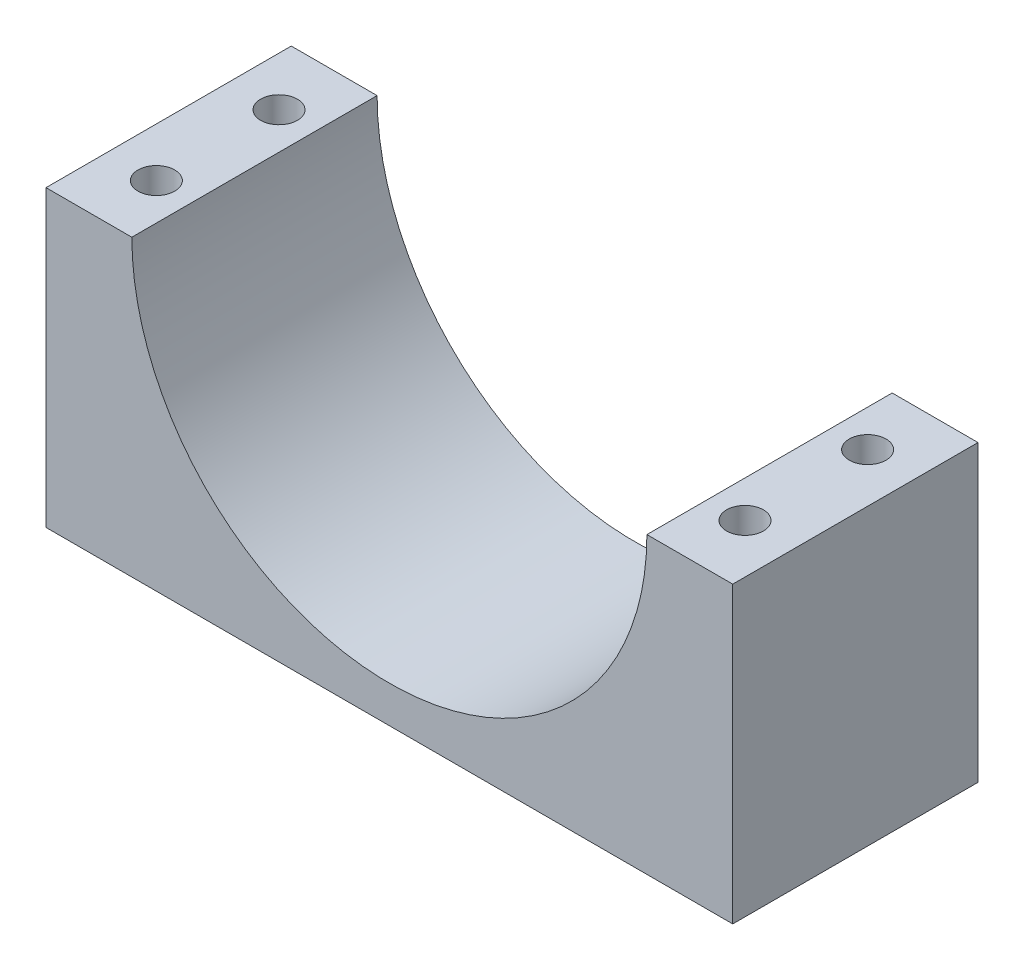
ISO-10303-21;
HEADER;
FILE_DESCRIPTION(('STEP AP214'),'2;1');
FILE_NAME('part.step','',(''),(''),'','','');
FILE_SCHEMA(('AUTOMOTIVE_DESIGN { 1 0 10303 214 1 1 1 1 }'));
ENDSEC;
DATA;
#1=APPLICATION_CONTEXT('core data for automotive mechanical design processes');
#2=APPLICATION_PROTOCOL_DEFINITION('international standard','automotive_design',2000,#1);
#3=PRODUCT_CONTEXT('',#1,'mechanical');
#4=PRODUCT('Part','Part','',(#3));
#5=PRODUCT_RELATED_PRODUCT_CATEGORY('part','',(#4));
#6=PRODUCT_DEFINITION_FORMATION('','',#4);
#7=PRODUCT_DEFINITION_CONTEXT('part definition',#1,'design');
#8=PRODUCT_DEFINITION('design','',#6,#7);
#9=PRODUCT_DEFINITION_SHAPE('','',#8);
#10=(LENGTH_UNIT() NAMED_UNIT(*) SI_UNIT(.MILLI.,.METRE.));
#11=(NAMED_UNIT(*) PLANE_ANGLE_UNIT() SI_UNIT($,.RADIAN.));
#12=(NAMED_UNIT(*) SI_UNIT($,.STERADIAN.) SOLID_ANGLE_UNIT());
#13=UNCERTAINTY_MEASURE_WITH_UNIT(LENGTH_MEASURE(1.E-05),#10,'distance_accuracy_value','');
#14=(GEOMETRIC_REPRESENTATION_CONTEXT(3) GLOBAL_UNCERTAINTY_ASSIGNED_CONTEXT((#13)) GLOBAL_UNIT_ASSIGNED_CONTEXT((#10,
#11,#12)) REPRESENTATION_CONTEXT('',''));
#15=CARTESIAN_POINT('',(0.,0.,0.));
#16=DIRECTION('',(0.,0.,1.));
#17=DIRECTION('',(1.,0.,0.));
#18=AXIS2_PLACEMENT_3D('',#15,#16,#17);
#19=CARTESIAN_POINT('',(-21.,0.,20.));
#20=DIRECTION('',(0.,-1.,0.));
#21=DIRECTION('',(1.,0.,0.));
#22=AXIS2_PLACEMENT_3D('',#19,#20,#21);
#23=PLANE('',#22);
#24=CARTESIAN_POINT('',(-24.,0.,5.));
#25=DIRECTION('',(0.,1.,0.));
#26=DIRECTION('',(0.,0.,1.));
#27=AXIS2_PLACEMENT_3D('',#24,#25,#26);
#28=CIRCLE('',#27,1.5);
#29=CARTESIAN_POINT('',(-24.,0.,6.5));
#30=VERTEX_POINT('',#29);
#31=EDGE_CURVE('E165',#30,#30,#28,.T.);
#32=ORIENTED_EDGE('',*,*,#31,.F.);
#33=EDGE_LOOP('',(#32));
#34=FACE_BOUND('',#33,.T.);
#35=CARTESIAN_POINT('',(-24.,0.,15.));
#36=DIRECTION('',(0.,1.,0.));
#37=DIRECTION('',(0.,0.,1.));
#38=AXIS2_PLACEMENT_3D('',#35,#36,#37);
#39=CIRCLE('',#38,1.5);
#40=CARTESIAN_POINT('',(-24.,0.,16.5));
#41=VERTEX_POINT('',#40);
#42=EDGE_CURVE('E168',#41,#41,#39,.T.);
#43=ORIENTED_EDGE('',*,*,#42,.F.);
#44=EDGE_LOOP('',(#43));
#45=FACE_BOUND('',#44,.T.);
#46=DIRECTION('',(-1.,0.,0.));
#47=VECTOR('',#46,1.);
#48=CARTESIAN_POINT('',(-21.,0.,0.));
#49=LINE('',#48,#47);
#50=CARTESIAN_POINT('',(-21.,0.,0.));
#51=VERTEX_POINT('',#50);
#52=CARTESIAN_POINT('',(-28.,0.,0.));
#53=VERTEX_POINT('',#52);
#54=EDGE_CURVE('E121',#51,#53,#49,.T.);
#55=ORIENTED_EDGE('',*,*,#54,.T.);
#56=DIRECTION('',(0.,0.,-1.));
#57=VECTOR('',#56,1.);
#58=CARTESIAN_POINT('',(-28.,0.,20.));
#59=LINE('',#58,#57);
#60=CARTESIAN_POINT('',(-28.,0.,20.));
#61=VERTEX_POINT('',#60);
#62=EDGE_CURVE('E11',#61,#53,#59,.T.);
#63=ORIENTED_EDGE('',*,*,#62,.F.);
#64=DIRECTION('',(-1.,0.,0.));
#65=VECTOR('',#64,1.);
#66=CARTESIAN_POINT('',(-21.,0.,20.));
#67=LINE('',#66,#65);
#68=CARTESIAN_POINT('',(-21.,0.,20.));
#69=VERTEX_POINT('',#68);
#70=EDGE_CURVE('E132',#69,#61,#67,.T.);
#71=ORIENTED_EDGE('',*,*,#70,.F.);
#72=DIRECTION('',(0.,0.,-1.));
#73=VECTOR('',#72,1.);
#74=CARTESIAN_POINT('',(-21.,0.,20.));
#75=LINE('',#74,#73);
#76=EDGE_CURVE('E117',#69,#51,#75,.T.);
#77=ORIENTED_EDGE('',*,*,#76,.T.);
#78=EDGE_LOOP('',(#55,#63,#71,#77));
#79=FACE_BOUND('',#78,.T.);
#80=ADVANCED_FACE('F37',(#34,#45,#79),#23,.F.);
#81=CARTESIAN_POINT('',(-28.,-24.,20.));
#82=DIRECTION('',(1.,0.,0.));
#83=DIRECTION('',(0.,0.,-1.));
#84=AXIS2_PLACEMENT_3D('',#81,#82,#83);
#85=PLANE('',#84);
#86=DIRECTION('',(0.,-1.,0.));
#87=VECTOR('',#86,1.);
#88=CARTESIAN_POINT('',(-28.,-24.,0.));
#89=LINE('',#88,#87);
#90=CARTESIAN_POINT('',(-28.,-24.,0.));
#91=VERTEX_POINT('',#90);
#92=EDGE_CURVE('E124',#53,#91,#89,.T.);
#93=ORIENTED_EDGE('',*,*,#92,.T.);
#94=DIRECTION('',(0.,0.,-1.));
#95=VECTOR('',#94,1.);
#96=CARTESIAN_POINT('',(-28.,-24.,20.));
#97=LINE('',#96,#95);
#98=CARTESIAN_POINT('',(-28.,-24.,20.));
#99=VERTEX_POINT('',#98);
#100=EDGE_CURVE('E45',#99,#91,#97,.T.);
#101=ORIENTED_EDGE('',*,*,#100,.F.);
#102=DIRECTION('',(0.,-1.,0.));
#103=VECTOR('',#102,1.);
#104=CARTESIAN_POINT('',(-28.,-24.,20.));
#105=LINE('',#104,#103);
#106=EDGE_CURVE('E90',#61,#99,#105,.T.);
#107=ORIENTED_EDGE('',*,*,#106,.F.);
#108=ORIENTED_EDGE('',*,*,#62,.T.);
#109=EDGE_LOOP('',(#93,#101,#107,#108));
#110=FACE_BOUND('',#109,.T.);
#111=ADVANCED_FACE('F157',(#110),#85,.F.);
#112=CARTESIAN_POINT('',(-28.,-24.,20.));
#113=DIRECTION('',(0.,1.,0.));
#114=DIRECTION('',(0.,0.,1.));
#115=AXIS2_PLACEMENT_3D('',#112,#113,#114);
#116=PLANE('',#115);
#117=CARTESIAN_POINT('',(24.,-24.,5.));
#118=DIRECTION('',(0.,-1.,0.));
#119=DIRECTION('',(0.,0.,1.));
#120=AXIS2_PLACEMENT_3D('',#117,#118,#119);
#121=CIRCLE('',#120,1.5);
#122=CARTESIAN_POINT('',(24.,-24.,6.5));
#123=VERTEX_POINT('',#122);
#124=EDGE_CURVE('E171',#123,#123,#121,.T.);
#125=ORIENTED_EDGE('',*,*,#124,.F.);
#126=EDGE_LOOP('',(#125));
#127=FACE_BOUND('',#126,.T.);
#128=CARTESIAN_POINT('',(24.,-24.,15.));
#129=DIRECTION('',(0.,-1.,0.));
#130=DIRECTION('',(0.,0.,1.));
#131=AXIS2_PLACEMENT_3D('',#128,#129,#130);
#132=CIRCLE('',#131,1.5);
#133=CARTESIAN_POINT('',(24.,-24.,16.5));
#134=VERTEX_POINT('',#133);
#135=EDGE_CURVE('E187',#134,#134,#132,.T.);
#136=ORIENTED_EDGE('',*,*,#135,.F.);
#137=EDGE_LOOP('',(#136));
#138=FACE_BOUND('',#137,.T.);
#139=CARTESIAN_POINT('',(-24.,-24.,5.));
#140=DIRECTION('',(0.,1.,0.));
#141=DIRECTION('',(0.,0.,1.));
#142=AXIS2_PLACEMENT_3D('',#139,#140,#141);
#143=CIRCLE('',#142,1.5);
#144=CARTESIAN_POINT('',(-24.,-24.,6.5));
#145=VERTEX_POINT('',#144);
#146=EDGE_CURVE('E125',#145,#145,#143,.T.);
#147=ORIENTED_EDGE('',*,*,#146,.T.);
#148=EDGE_LOOP('',(#147));
#149=FACE_BOUND('',#148,.T.);
#150=CARTESIAN_POINT('',(-24.,-24.,15.));
#151=DIRECTION('',(0.,1.,0.));
#152=DIRECTION('',(0.,0.,1.));
#153=AXIS2_PLACEMENT_3D('',#150,#151,#152);
#154=CIRCLE('',#153,1.5);
#155=CARTESIAN_POINT('',(-24.,-24.,16.5));
#156=VERTEX_POINT('',#155);
#157=EDGE_CURVE('E170',#156,#156,#154,.T.);
#158=ORIENTED_EDGE('',*,*,#157,.T.);
#159=EDGE_LOOP('',(#158));
#160=FACE_BOUND('',#159,.T.);
#161=DIRECTION('',(1.,0.,0.));
#162=VECTOR('',#161,1.);
#163=CARTESIAN_POINT('',(-28.,-24.,0.));
#164=LINE('',#163,#162);
#165=CARTESIAN_POINT('',(28.,-24.,0.));
#166=VERTEX_POINT('',#165);
#167=EDGE_CURVE('E127',#91,#166,#164,.T.);
#168=ORIENTED_EDGE('',*,*,#167,.T.);
#169=DIRECTION('',(0.,0.,-1.));
#170=VECTOR('',#169,1.);
#171=CARTESIAN_POINT('',(28.,-24.,20.));
#172=LINE('',#171,#170);
#173=CARTESIAN_POINT('',(28.,-24.,20.));
#174=VERTEX_POINT('',#173);
#175=EDGE_CURVE('E112',#174,#166,#172,.T.);
#176=ORIENTED_EDGE('',*,*,#175,.F.);
#177=DIRECTION('',(1.,0.,0.));
#178=VECTOR('',#177,1.);
#179=CARTESIAN_POINT('',(-28.,-24.,20.));
#180=LINE('',#179,#178);
#181=EDGE_CURVE('E103',#99,#174,#180,.T.);
#182=ORIENTED_EDGE('',*,*,#181,.F.);
#183=ORIENTED_EDGE('',*,*,#100,.T.);
#184=EDGE_LOOP('',(#168,#176,#182,#183));
#185=FACE_BOUND('',#184,.T.);
#186=ADVANCED_FACE('F138',(#127,#138,#149,#160,#185),#116,.F.);
#187=CARTESIAN_POINT('',(28.,-24.,20.));
#188=DIRECTION('',(-1.,0.,0.));
#189=DIRECTION('',(0.,0.,1.));
#190=AXIS2_PLACEMENT_3D('',#187,#188,#189);
#191=PLANE('',#190);
#192=DIRECTION('',(0.,1.,0.));
#193=VECTOR('',#192,1.);
#194=CARTESIAN_POINT('',(28.,-24.,0.));
#195=LINE('',#194,#193);
#196=CARTESIAN_POINT('',(28.,0.,0.));
#197=VERTEX_POINT('',#196);
#198=EDGE_CURVE('E111',#166,#197,#195,.T.);
#199=ORIENTED_EDGE('',*,*,#198,.T.);
#200=DIRECTION('',(0.,0.,-1.));
#201=VECTOR('',#200,1.);
#202=CARTESIAN_POINT('',(28.,0.,20.));
#203=LINE('',#202,#201);
#204=CARTESIAN_POINT('',(28.,0.,20.));
#205=VERTEX_POINT('',#204);
#206=EDGE_CURVE('E108',#205,#197,#203,.T.);
#207=ORIENTED_EDGE('',*,*,#206,.F.);
#208=DIRECTION('',(0.,1.,0.));
#209=VECTOR('',#208,1.);
#210=CARTESIAN_POINT('',(28.,-24.,20.));
#211=LINE('',#210,#209);
#212=EDGE_CURVE('E97',#174,#205,#211,.T.);
#213=ORIENTED_EDGE('',*,*,#212,.F.);
#214=ORIENTED_EDGE('',*,*,#175,.T.);
#215=EDGE_LOOP('',(#199,#207,#213,#214));
#216=FACE_BOUND('',#215,.T.);
#217=ADVANCED_FACE('F109',(#216),#191,.F.);
#218=CARTESIAN_POINT('',(28.,0.,20.));
#219=DIRECTION('',(0.,-1.,0.));
#220=DIRECTION('',(1.,0.,0.));
#221=AXIS2_PLACEMENT_3D('',#218,#219,#220);
#222=PLANE('',#221);
#223=CARTESIAN_POINT('',(24.,0.,5.));
#224=DIRECTION('',(0.,-1.,0.));
#225=DIRECTION('',(0.,0.,1.));
#226=AXIS2_PLACEMENT_3D('',#223,#224,#225);
#227=CIRCLE('',#226,1.5);
#228=CARTESIAN_POINT('',(24.,0.,6.5));
#229=VERTEX_POINT('',#228);
#230=EDGE_CURVE('E176',#229,#229,#227,.T.);
#231=ORIENTED_EDGE('',*,*,#230,.T.);
#232=EDGE_LOOP('',(#231));
#233=FACE_BOUND('',#232,.T.);
#234=CARTESIAN_POINT('',(24.,0.,15.));
#235=DIRECTION('',(0.,-1.,0.));
#236=DIRECTION('',(0.,0.,1.));
#237=AXIS2_PLACEMENT_3D('',#234,#235,#236);
#238=CIRCLE('',#237,1.5);
#239=CARTESIAN_POINT('',(24.,0.,16.5));
#240=VERTEX_POINT('',#239);
#241=EDGE_CURVE('E184',#240,#240,#238,.T.);
#242=ORIENTED_EDGE('',*,*,#241,.T.);
#243=EDGE_LOOP('',(#242));
#244=FACE_BOUND('',#243,.T.);
#245=DIRECTION('',(-1.,0.,0.));
#246=VECTOR('',#245,1.);
#247=CARTESIAN_POINT('',(28.,0.,0.));
#248=LINE('',#247,#246);
#249=CARTESIAN_POINT('',(21.,0.,0.));
#250=VERTEX_POINT('',#249);
#251=EDGE_CURVE('E76',#197,#250,#248,.T.);
#252=ORIENTED_EDGE('',*,*,#251,.T.);
#253=DIRECTION('',(0.,0.,-1.));
#254=VECTOR('',#253,1.);
#255=CARTESIAN_POINT('',(21.,0.,20.));
#256=LINE('',#255,#254);
#257=CARTESIAN_POINT('',(21.,0.,20.));
#258=VERTEX_POINT('',#257);
#259=EDGE_CURVE('E113',#258,#250,#256,.T.);
#260=ORIENTED_EDGE('',*,*,#259,.F.);
#261=DIRECTION('',(-1.,0.,0.));
#262=VECTOR('',#261,1.);
#263=CARTESIAN_POINT('',(28.,0.,20.));
#264=LINE('',#263,#262);
#265=EDGE_CURVE('E101',#205,#258,#264,.T.);
#266=ORIENTED_EDGE('',*,*,#265,.F.);
#267=ORIENTED_EDGE('',*,*,#206,.T.);
#268=EDGE_LOOP('',(#252,#260,#266,#267));
#269=FACE_BOUND('',#268,.T.);
#270=ADVANCED_FACE('F115',(#233,#244,#269),#222,.F.);
#271=CARTESIAN_POINT('',(0.,0.,20.));
#272=DIRECTION('',(0.,0.,-1.));
#273=DIRECTION('',(-1.,0.,0.));
#274=AXIS2_PLACEMENT_3D('',#271,#272,#273);
#275=CYLINDRICAL_SURFACE('',#274,21.);
#276=CARTESIAN_POINT('',(0.,0.,0.));
#277=DIRECTION('',(0.,0.,-1.));
#278=DIRECTION('',(1.,0.,0.));
#279=AXIS2_PLACEMENT_3D('',#276,#277,#278);
#280=CIRCLE('',#279,21.);
#281=EDGE_CURVE('E82',#250,#51,#280,.T.);
#282=ORIENTED_EDGE('',*,*,#281,.T.);
#283=ORIENTED_EDGE('',*,*,#76,.F.);
#284=CARTESIAN_POINT('',(0.,0.,20.));
#285=DIRECTION('',(0.,0.,-1.));
#286=DIRECTION('',(1.,0.,0.));
#287=AXIS2_PLACEMENT_3D('',#284,#285,#286);
#288=CIRCLE('',#287,21.);
#289=EDGE_CURVE('E53',#258,#69,#288,.T.);
#290=ORIENTED_EDGE('',*,*,#289,.F.);
#291=ORIENTED_EDGE('',*,*,#259,.T.);
#292=EDGE_LOOP('',(#282,#283,#290,#291));
#293=FACE_BOUND('',#292,.T.);
#294=ADVANCED_FACE('F145',(#293),#275,.F.);
#295=CARTESIAN_POINT('',(0.,0.,20.));
#296=DIRECTION('',(0.,0.,1.));
#297=DIRECTION('',(1.,0.,0.));
#298=AXIS2_PLACEMENT_3D('',#295,#296,#297);
#299=PLANE('',#298);
#300=ORIENTED_EDGE('',*,*,#70,.T.);
#301=ORIENTED_EDGE('',*,*,#106,.T.);
#302=ORIENTED_EDGE('',*,*,#181,.T.);
#303=ORIENTED_EDGE('',*,*,#212,.T.);
#304=ORIENTED_EDGE('',*,*,#265,.T.);
#305=ORIENTED_EDGE('',*,*,#289,.T.);
#306=EDGE_LOOP('',(#300,#301,#302,#303,#304,#305));
#307=FACE_BOUND('',#306,.T.);
#308=ADVANCED_FACE('F99',(#307),#299,.T.);
#309=CARTESIAN_POINT('',(0.,0.,0.));
#310=DIRECTION('',(0.,0.,1.));
#311=DIRECTION('',(1.,0.,0.));
#312=AXIS2_PLACEMENT_3D('',#309,#310,#311);
#313=PLANE('',#312);
#314=ORIENTED_EDGE('',*,*,#54,.F.);
#315=ORIENTED_EDGE('',*,*,#281,.F.);
#316=ORIENTED_EDGE('',*,*,#251,.F.);
#317=ORIENTED_EDGE('',*,*,#198,.F.);
#318=ORIENTED_EDGE('',*,*,#167,.F.);
#319=ORIENTED_EDGE('',*,*,#92,.F.);
#320=EDGE_LOOP('',(#314,#315,#316,#317,#318,#319));
#321=FACE_BOUND('',#320,.T.);
#322=ADVANCED_FACE('F141',(#321),#313,.F.);
#323=CARTESIAN_POINT('',(-24.,-24.,15.));
#324=DIRECTION('',(0.,1.,0.));
#325=DIRECTION('',(0.,0.,1.));
#326=AXIS2_PLACEMENT_3D('',#323,#324,#325);
#327=CYLINDRICAL_SURFACE('',#326,1.5);
#328=ORIENTED_EDGE('',*,*,#157,.F.);
#329=EDGE_LOOP('',(#328));
#330=FACE_BOUND('',#329,.T.);
#331=ORIENTED_EDGE('',*,*,#42,.T.);
#332=EDGE_LOOP('',(#331));
#333=FACE_BOUND('',#332,.T.);
#334=ADVANCED_FACE('F208',(#330,#333),#327,.F.);
#335=CARTESIAN_POINT('',(-24.,-24.,5.));
#336=DIRECTION('',(0.,1.,0.));
#337=DIRECTION('',(0.,0.,1.));
#338=AXIS2_PLACEMENT_3D('',#335,#336,#337);
#339=CYLINDRICAL_SURFACE('',#338,1.5);
#340=ORIENTED_EDGE('',*,*,#146,.F.);
#341=EDGE_LOOP('',(#340));
#342=FACE_BOUND('',#341,.T.);
#343=ORIENTED_EDGE('',*,*,#31,.T.);
#344=EDGE_LOOP('',(#343));
#345=FACE_BOUND('',#344,.T.);
#346=ADVANCED_FACE('F202',(#342,#345),#339,.F.);
#347=CARTESIAN_POINT('',(24.,-24.,15.));
#348=DIRECTION('',(0.,1.,0.));
#349=DIRECTION('',(0.,0.,1.));
#350=AXIS2_PLACEMENT_3D('',#347,#348,#349);
#351=CYLINDRICAL_SURFACE('',#350,1.5);
#352=ORIENTED_EDGE('',*,*,#135,.T.);
#353=EDGE_LOOP('',(#352));
#354=FACE_BOUND('',#353,.T.);
#355=ORIENTED_EDGE('',*,*,#241,.F.);
#356=EDGE_LOOP('',(#355));
#357=FACE_BOUND('',#356,.T.);
#358=ADVANCED_FACE('F196',(#354,#357),#351,.F.);
#359=CARTESIAN_POINT('',(24.,-24.,5.));
#360=DIRECTION('',(0.,1.,0.));
#361=DIRECTION('',(0.,0.,1.));
#362=AXIS2_PLACEMENT_3D('',#359,#360,#361);
#363=CYLINDRICAL_SURFACE('',#362,1.5);
#364=ORIENTED_EDGE('',*,*,#124,.T.);
#365=EDGE_LOOP('',(#364));
#366=FACE_BOUND('',#365,.T.);
#367=ORIENTED_EDGE('',*,*,#230,.F.);
#368=EDGE_LOOP('',(#367));
#369=FACE_BOUND('',#368,.T.);
#370=ADVANCED_FACE('F194',(#366,#369),#363,.F.);
#371=CLOSED_SHELL('',(#80,#111,#186,#217,#270,#294,#308,#322,#334,#346,#358,#370));
#372=MANIFOLD_SOLID_BREP('B2',#371);
#373=ADVANCED_BREP_SHAPE_REPRESENTATION('',(#18,#372),#14);
#374=SHAPE_DEFINITION_REPRESENTATION(#9,#373);
ENDSEC;
END-ISO-10303-21;
